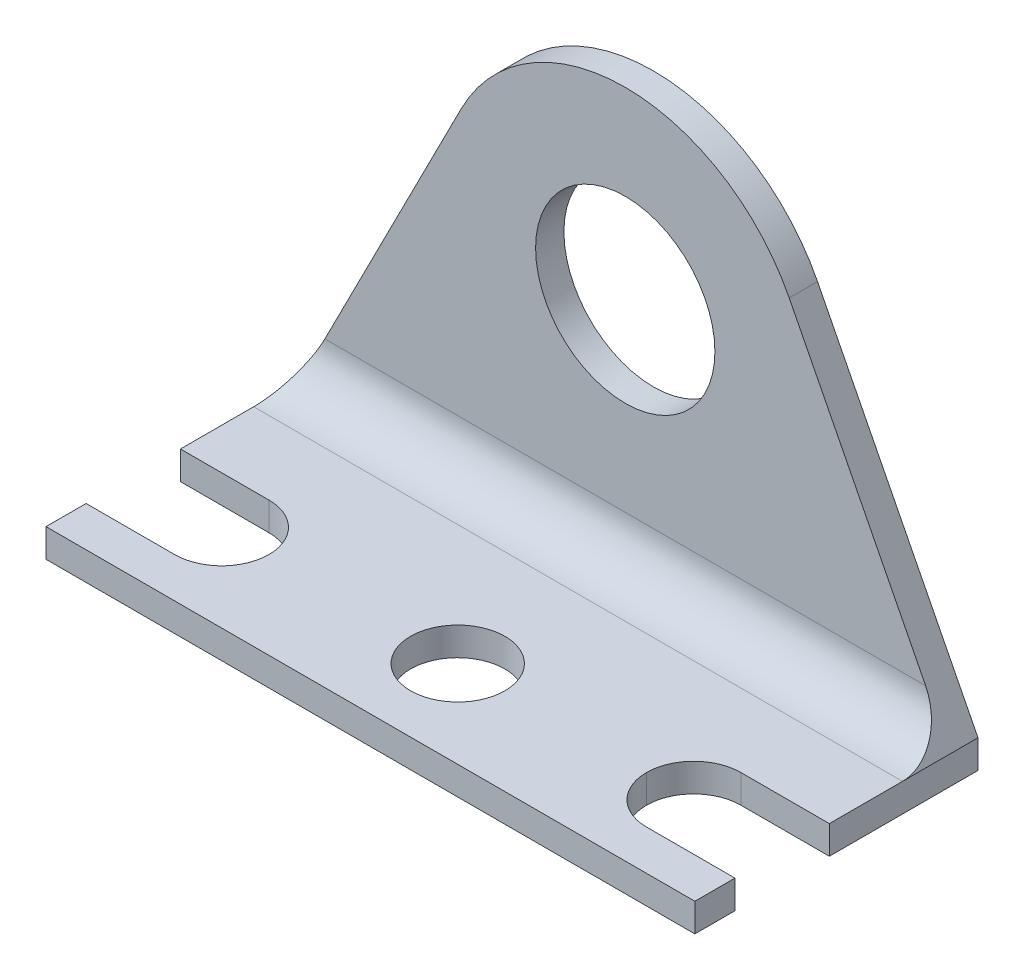
ISO-10303-21;
HEADER;
FILE_DESCRIPTION(('STEP AP214'),'2;1');
FILE_NAME('part.step','',(''),(''),'','','');
FILE_SCHEMA(('AUTOMOTIVE_DESIGN { 1 0 10303 214 1 1 1 1 }'));
ENDSEC;
DATA;
#1=APPLICATION_CONTEXT('core data for automotive mechanical design processes');
#2=APPLICATION_PROTOCOL_DEFINITION('international standard','automotive_design',2000,#1);
#3=PRODUCT_CONTEXT('',#1,'mechanical');
#4=PRODUCT('Part','Part','',(#3));
#5=PRODUCT_RELATED_PRODUCT_CATEGORY('part','',(#4));
#6=PRODUCT_DEFINITION_FORMATION('','',#4);
#7=PRODUCT_DEFINITION_CONTEXT('part definition',#1,'design');
#8=PRODUCT_DEFINITION('design','',#6,#7);
#9=PRODUCT_DEFINITION_SHAPE('','',#8);
#10=(LENGTH_UNIT() NAMED_UNIT(*) SI_UNIT(.MILLI.,.METRE.));
#11=(NAMED_UNIT(*) PLANE_ANGLE_UNIT() SI_UNIT($,.RADIAN.));
#12=(NAMED_UNIT(*) SI_UNIT($,.STERADIAN.) SOLID_ANGLE_UNIT());
#13=UNCERTAINTY_MEASURE_WITH_UNIT(LENGTH_MEASURE(1.E-05),#10,'distance_accuracy_value','');
#14=(GEOMETRIC_REPRESENTATION_CONTEXT(3) GLOBAL_UNCERTAINTY_ASSIGNED_CONTEXT((#13)) GLOBAL_UNIT_ASSIGNED_CONTEXT((#10,
#11,#12)) REPRESENTATION_CONTEXT('',''));
#15=CARTESIAN_POINT('',(0.,0.,0.));
#16=DIRECTION('',(0.,0.,1.));
#17=DIRECTION('',(1.,0.,0.));
#18=AXIS2_PLACEMENT_3D('',#15,#16,#17);
#19=CARTESIAN_POINT('',(17.4625,0.,1.524));
#20=DIRECTION('',(-1.,0.,0.));
#21=DIRECTION('',(0.,0.,1.));
#22=AXIS2_PLACEMENT_3D('',#19,#20,#21);
#23=PLANE('',#22);
#24=DIRECTION('',(0.,0.,-1.));
#25=VECTOR('',#24,1.);
#26=CARTESIAN_POINT('',(17.4625,1.524,15.24));
#27=LINE('',#26,#25);
#28=CARTESIAN_POINT('',(17.4625,1.524,8.001));
#29=VERTEX_POINT('',#28);
#30=CARTESIAN_POINT('',(17.4625,1.524,4.06400000000001));
#31=VERTEX_POINT('',#30);
#32=EDGE_CURVE('E250',#29,#31,#27,.T.);
#33=ORIENTED_EDGE('',*,*,#32,.F.);
#34=DIRECTION('',(0.,-1.,0.));
#35=VECTOR('',#34,1.);
#36=CARTESIAN_POINT('',(17.4625,0.,8.001));
#37=LINE('',#36,#35);
#38=CARTESIAN_POINT('',(17.4625,0.,8.001));
#39=VERTEX_POINT('',#38);
#40=EDGE_CURVE('E180',#29,#39,#37,.T.);
#41=ORIENTED_EDGE('',*,*,#40,.T.);
#42=DIRECTION('',(0.,0.,-1.));
#43=VECTOR('',#42,1.);
#44=CARTESIAN_POINT('',(17.4625,0.,1.524));
#45=LINE('',#44,#43);
#46=CARTESIAN_POINT('',(17.4625,0.,0.));
#47=VERTEX_POINT('',#46);
#48=EDGE_CURVE('E280',#39,#47,#45,.T.);
#49=ORIENTED_EDGE('',*,*,#48,.T.);
#50=DIRECTION('',(0.,1.,0.));
#51=VECTOR('',#50,1.);
#52=CARTESIAN_POINT('',(17.4625,0.,0.));
#53=LINE('',#52,#51);
#54=CARTESIAN_POINT('',(17.4625,1.524,0.));
#55=VERTEX_POINT('',#54);
#56=EDGE_CURVE('E259',#47,#55,#53,.T.);
#57=ORIENTED_EDGE('',*,*,#56,.T.);
#58=DIRECTION('',(0.,0.,-1.));
#59=VECTOR('',#58,1.);
#60=CARTESIAN_POINT('',(17.4625,1.524,1.524));
#61=LINE('',#60,#59);
#62=EDGE_CURVE('E51',#31,#55,#61,.T.);
#63=ORIENTED_EDGE('',*,*,#62,.F.);
#64=EDGE_LOOP('',(#33,#41,#49,#57,#63));
#65=FACE_BOUND('',#64,.T.);
#66=ADVANCED_FACE('F36',(#65),#23,.F.);
#67=CARTESIAN_POINT('',(-17.4625,0.,1.524));
#68=DIRECTION('',(1.,0.,0.));
#69=DIRECTION('',(0.,0.,-1.));
#70=AXIS2_PLACEMENT_3D('',#67,#68,#69);
#71=PLANE('',#70);
#72=DIRECTION('',(0.,-1.,0.));
#73=VECTOR('',#72,1.);
#74=CARTESIAN_POINT('',(-17.4625,57.73338257144,8.001));
#75=LINE('',#74,#73);
#76=CARTESIAN_POINT('',(-17.4625,1.524,8.001));
#77=VERTEX_POINT('',#76);
#78=CARTESIAN_POINT('',(-17.4625,0.,8.001));
#79=VERTEX_POINT('',#78);
#80=EDGE_CURVE('E220',#77,#79,#75,.T.);
#81=ORIENTED_EDGE('',*,*,#80,.F.);
#82=DIRECTION('',(0.,0.,-1.));
#83=VECTOR('',#82,1.);
#84=CARTESIAN_POINT('',(-17.4625,1.524,15.24));
#85=LINE('',#84,#83);
#86=CARTESIAN_POINT('',(-17.4625,1.524,4.06400000000001));
#87=VERTEX_POINT('',#86);
#88=EDGE_CURVE('E247',#77,#87,#85,.T.);
#89=ORIENTED_EDGE('',*,*,#88,.T.);
#90=DIRECTION('',(0.,0.,-1.));
#91=VECTOR('',#90,1.);
#92=CARTESIAN_POINT('',(-17.4625,1.524,1.524));
#93=LINE('',#92,#91);
#94=CARTESIAN_POINT('',(-17.4625,1.524,0.));
#95=VERTEX_POINT('',#94);
#96=EDGE_CURVE('E68',#87,#95,#93,.T.);
#97=ORIENTED_EDGE('',*,*,#96,.T.);
#98=DIRECTION('',(0.,-1.,0.));
#99=VECTOR('',#98,1.);
#100=CARTESIAN_POINT('',(-17.4625,0.,0.));
#101=LINE('',#100,#99);
#102=CARTESIAN_POINT('',(-17.4625,0.,0.));
#103=VERTEX_POINT('',#102);
#104=EDGE_CURVE('E268',#95,#103,#101,.T.);
#105=ORIENTED_EDGE('',*,*,#104,.T.);
#106=DIRECTION('',(0.,0.,-1.));
#107=VECTOR('',#106,1.);
#108=CARTESIAN_POINT('',(-17.4625,0.,1.524));
#109=LINE('',#108,#107);
#110=EDGE_CURVE('E284',#79,#103,#109,.T.);
#111=ORIENTED_EDGE('',*,*,#110,.F.);
#112=EDGE_LOOP('',(#81,#89,#97,#105,#111));
#113=FACE_BOUND('',#112,.T.);
#114=ADVANCED_FACE('F335',(#113),#71,.F.);
#115=DIRECTION('',(0.,-1.,0.));
#116=VECTOR('',#115,1.);
#117=CARTESIAN_POINT('',(-17.4625,57.73338257144,13.081));
#118=LINE('',#117,#116);
#119=CARTESIAN_POINT('',(-17.4625,1.524,13.081));
#120=VERTEX_POINT('',#119);
#121=CARTESIAN_POINT('',(-17.4625,0.,13.081));
#122=VERTEX_POINT('',#121);
#123=EDGE_CURVE('E208',#120,#122,#118,.T.);
#124=ORIENTED_EDGE('',*,*,#123,.T.);
#125=CARTESIAN_POINT('',(-17.4625,0.,15.24));
#126=VERTEX_POINT('',#125);
#127=EDGE_CURVE('E285',#126,#122,#109,.T.);
#128=ORIENTED_EDGE('',*,*,#127,.F.);
#129=DIRECTION('',(0.,1.,0.));
#130=VECTOR('',#129,1.);
#131=CARTESIAN_POINT('',(-17.4625,1.524,15.24));
#132=LINE('',#131,#130);
#133=CARTESIAN_POINT('',(-17.4625,1.524,15.24));
#134=VERTEX_POINT('',#133);
#135=EDGE_CURVE('E236',#126,#134,#132,.T.);
#136=ORIENTED_EDGE('',*,*,#135,.T.);
#137=EDGE_CURVE('E251',#134,#120,#85,.T.);
#138=ORIENTED_EDGE('',*,*,#137,.T.);
#139=EDGE_LOOP('',(#124,#128,#136,#138));
#140=FACE_BOUND('',#139,.T.);
#141=ADVANCED_FACE('F357',(#140),#71,.F.);
#142=CARTESIAN_POINT('',(-17.4625,0.,1.524));
#143=DIRECTION('',(0.,1.,0.));
#144=DIRECTION('',(0.,0.,1.));
#145=AXIS2_PLACEMENT_3D('',#142,#143,#144);
#146=PLANE('',#145);
#147=CARTESIAN_POINT('',(0.,0.,10.541));
#148=DIRECTION('',(0.,1.,0.));
#149=DIRECTION('',(0.,0.,1.));
#150=AXIS2_PLACEMENT_3D('',#147,#148,#149);
#151=CIRCLE('',#150,2.54);
#152=CARTESIAN_POINT('',(0.,0.,13.081));
#153=VERTEX_POINT('',#152);
#154=EDGE_CURVE('E233',#153,#153,#151,.T.);
#155=ORIENTED_EDGE('',*,*,#154,.T.);
#156=EDGE_LOOP('',(#155));
#157=FACE_BOUND('',#156,.T.);
#158=ORIENTED_EDGE('',*,*,#48,.F.);
#159=DIRECTION('',(-1.,0.,0.));
#160=VECTOR('',#159,1.);
#161=CARTESIAN_POINT('',(-17.4625,0.,8.00099999999999));
#162=LINE('',#161,#160);
#163=CARTESIAN_POINT('',(12.7,0.,8.001));
#164=VERTEX_POINT('',#163);
#165=EDGE_CURVE('E200',#39,#164,#162,.T.);
#166=ORIENTED_EDGE('',*,*,#165,.T.);
#167=CARTESIAN_POINT('',(12.7,0.,10.541));
#168=DIRECTION('',(0.,1.,0.));
#169=DIRECTION('',(0.,0.,1.));
#170=AXIS2_PLACEMENT_3D('',#167,#168,#169);
#171=CIRCLE('',#170,2.54);
#172=CARTESIAN_POINT('',(10.16,0.,10.541));
#173=VERTEX_POINT('',#172);
#174=EDGE_CURVE('E205',#164,#173,#171,.T.);
#175=ORIENTED_EDGE('',*,*,#174,.T.);
#176=CARTESIAN_POINT('',(12.7,0.,10.541));
#177=DIRECTION('',(0.,1.,0.));
#178=DIRECTION('',(0.,0.,1.));
#179=AXIS2_PLACEMENT_3D('',#176,#177,#178);
#180=CIRCLE('',#179,2.54);
#181=CARTESIAN_POINT('',(12.7,0.,13.081));
#182=VERTEX_POINT('',#181);
#183=EDGE_CURVE('E203',#173,#182,#180,.T.);
#184=ORIENTED_EDGE('',*,*,#183,.T.);
#185=DIRECTION('',(1.,0.,0.));
#186=VECTOR('',#185,1.);
#187=CARTESIAN_POINT('',(-17.4625,0.,13.081));
#188=LINE('',#187,#186);
#189=CARTESIAN_POINT('',(17.4625,0.,13.081));
#190=VERTEX_POINT('',#189);
#191=EDGE_CURVE('E184',#182,#190,#188,.T.);
#192=ORIENTED_EDGE('',*,*,#191,.T.);
#193=CARTESIAN_POINT('',(17.4625,0.,15.24));
#194=VERTEX_POINT('',#193);
#195=EDGE_CURVE('E281',#194,#190,#45,.T.);
#196=ORIENTED_EDGE('',*,*,#195,.F.);
#197=DIRECTION('',(-1.,0.,0.));
#198=VECTOR('',#197,1.);
#199=CARTESIAN_POINT('',(-17.4625,0.,15.24));
#200=LINE('',#199,#198);
#201=EDGE_CURVE('E244',#194,#126,#200,.T.);
#202=ORIENTED_EDGE('',*,*,#201,.T.);
#203=ORIENTED_EDGE('',*,*,#127,.T.);
#204=DIRECTION('',(-1.,0.,0.));
#205=VECTOR('',#204,1.);
#206=CARTESIAN_POINT('',(-17.4625,0.,13.081));
#207=LINE('',#206,#205);
#208=CARTESIAN_POINT('',(-12.7,0.,13.081));
#209=VERTEX_POINT('',#208);
#210=EDGE_CURVE('E222',#209,#122,#207,.T.);
#211=ORIENTED_EDGE('',*,*,#210,.F.);
#212=CARTESIAN_POINT('',(-12.7,0.,10.541));
#213=DIRECTION('',(0.,1.,0.));
#214=DIRECTION('',(0.,0.,1.));
#215=AXIS2_PLACEMENT_3D('',#212,#213,#214);
#216=CIRCLE('',#215,2.54);
#217=CARTESIAN_POINT('',(-10.16,0.,10.541));
#218=VERTEX_POINT('',#217);
#219=EDGE_CURVE('E224',#218,#209,#216,.F.);
#220=ORIENTED_EDGE('',*,*,#219,.F.);
#221=CARTESIAN_POINT('',(-12.7,0.,10.541));
#222=DIRECTION('',(0.,1.,0.));
#223=DIRECTION('',(0.,0.,1.));
#224=AXIS2_PLACEMENT_3D('',#221,#222,#223);
#225=CIRCLE('',#224,2.54);
#226=CARTESIAN_POINT('',(-12.7,0.,8.001));
#227=VERTEX_POINT('',#226);
#228=EDGE_CURVE('E226',#227,#218,#225,.F.);
#229=ORIENTED_EDGE('',*,*,#228,.F.);
#230=DIRECTION('',(1.,0.,0.));
#231=VECTOR('',#230,1.);
#232=CARTESIAN_POINT('',(-17.4625,0.,8.001));
#233=LINE('',#232,#231);
#234=EDGE_CURVE('E228',#79,#227,#233,.T.);
#235=ORIENTED_EDGE('',*,*,#234,.F.);
#236=ORIENTED_EDGE('',*,*,#110,.T.);
#237=DIRECTION('',(1.,0.,0.));
#238=VECTOR('',#237,1.);
#239=CARTESIAN_POINT('',(-17.4625,0.,0.));
#240=LINE('',#239,#238);
#241=EDGE_CURVE('E271',#103,#47,#240,.T.);
#242=ORIENTED_EDGE('',*,*,#241,.T.);
#243=EDGE_LOOP('',(#158,#166,#175,#184,#192,#196,#202,#203,#211,#220,#229,#235,#236,#242));
#244=FACE_BOUND('',#243,.T.);
#245=ADVANCED_FACE('F345',(#157,#244),#146,.F.);
#246=CARTESIAN_POINT('',(-17.4625,1.524,15.24));
#247=DIRECTION('',(0.,1.,0.));
#248=DIRECTION('',(0.,0.,1.));
#249=AXIS2_PLACEMENT_3D('',#246,#247,#248);
#250=PLANE('',#249);
#251=ORIENTED_EDGE('',*,*,#32,.T.);
#252=DIRECTION('',(-1.,0.,0.));
#253=VECTOR('',#252,1.);
#254=CARTESIAN_POINT('',(-17.4625,1.524,4.06400000000001));
#255=LINE('',#254,#253);
#256=EDGE_CURVE('E313',#31,#87,#255,.T.);
#257=ORIENTED_EDGE('',*,*,#256,.T.);
#258=ORIENTED_EDGE('',*,*,#88,.F.);
#259=DIRECTION('',(1.,0.,0.));
#260=VECTOR('',#259,1.);
#261=CARTESIAN_POINT('',(-17.4625,1.524,8.001));
#262=LINE('',#261,#260);
#263=CARTESIAN_POINT('',(-12.7,1.524,8.001));
#264=VERTEX_POINT('',#263);
#265=EDGE_CURVE('E305',#77,#264,#262,.T.);
#266=ORIENTED_EDGE('',*,*,#265,.T.);
#267=CARTESIAN_POINT('',(-12.7,1.524,10.541));
#268=DIRECTION('',(0.,1.,0.));
#269=DIRECTION('',(0.,0.,1.));
#270=AXIS2_PLACEMENT_3D('',#267,#268,#269);
#271=CIRCLE('',#270,2.54);
#272=CARTESIAN_POINT('',(-10.16,1.524,10.541));
#273=VERTEX_POINT('',#272);
#274=EDGE_CURVE('E302',#264,#273,#271,.F.);
#275=ORIENTED_EDGE('',*,*,#274,.T.);
#276=CARTESIAN_POINT('',(-12.7,1.524,10.541));
#277=DIRECTION('',(0.,1.,0.));
#278=DIRECTION('',(0.,0.,1.));
#279=AXIS2_PLACEMENT_3D('',#276,#277,#278);
#280=CIRCLE('',#279,2.54);
#281=CARTESIAN_POINT('',(-12.7,1.524,13.081));
#282=VERTEX_POINT('',#281);
#283=EDGE_CURVE('E299',#273,#282,#280,.F.);
#284=ORIENTED_EDGE('',*,*,#283,.T.);
#285=DIRECTION('',(-1.,0.,0.));
#286=VECTOR('',#285,1.);
#287=CARTESIAN_POINT('',(-17.4625,1.524,13.081));
#288=LINE('',#287,#286);
#289=EDGE_CURVE('E296',#282,#120,#288,.T.);
#290=ORIENTED_EDGE('',*,*,#289,.T.);
#291=ORIENTED_EDGE('',*,*,#137,.F.);
#292=DIRECTION('',(1.,0.,0.));
#293=VECTOR('',#292,1.);
#294=CARTESIAN_POINT('',(-17.4625,1.524,15.24));
#295=LINE('',#294,#293);
#296=CARTESIAN_POINT('',(17.4625,1.524,15.24));
#297=VERTEX_POINT('',#296);
#298=EDGE_CURVE('E239',#134,#297,#295,.T.);
#299=ORIENTED_EDGE('',*,*,#298,.T.);
#300=CARTESIAN_POINT('',(17.4625,1.524,13.081));
#301=VERTEX_POINT('',#300);
#302=EDGE_CURVE('E190',#297,#301,#27,.T.);
#303=ORIENTED_EDGE('',*,*,#302,.T.);
#304=DIRECTION('',(1.,0.,0.));
#305=VECTOR('',#304,1.);
#306=CARTESIAN_POINT('',(-17.4625,1.524,13.081));
#307=LINE('',#306,#305);
#308=CARTESIAN_POINT('',(12.7,1.524,13.081));
#309=VERTEX_POINT('',#308);
#310=EDGE_CURVE('E75',#309,#301,#307,.T.);
#311=ORIENTED_EDGE('',*,*,#310,.F.);
#312=CARTESIAN_POINT('',(12.7,1.524,10.541));
#313=DIRECTION('',(0.,1.,0.));
#314=DIRECTION('',(0.,0.,1.));
#315=AXIS2_PLACEMENT_3D('',#312,#313,#314);
#316=CIRCLE('',#315,2.54);
#317=CARTESIAN_POINT('',(10.16,1.524,10.541));
#318=VERTEX_POINT('',#317);
#319=EDGE_CURVE('E171',#318,#309,#316,.T.);
#320=ORIENTED_EDGE('',*,*,#319,.F.);
#321=CARTESIAN_POINT('',(12.7,1.524,10.541));
#322=DIRECTION('',(0.,1.,0.));
#323=DIRECTION('',(0.,0.,1.));
#324=AXIS2_PLACEMENT_3D('',#321,#322,#323);
#325=CIRCLE('',#324,2.54);
#326=CARTESIAN_POINT('',(12.7,1.524,8.001));
#327=VERTEX_POINT('',#326);
#328=EDGE_CURVE('E179',#327,#318,#325,.T.);
#329=ORIENTED_EDGE('',*,*,#328,.F.);
#330=DIRECTION('',(-1.,0.,0.));
#331=VECTOR('',#330,1.);
#332=CARTESIAN_POINT('',(-17.4625,1.524,8.00099999999999));
#333=LINE('',#332,#331);
#334=EDGE_CURVE('E193',#29,#327,#333,.T.);
#335=ORIENTED_EDGE('',*,*,#334,.F.);
#336=EDGE_LOOP('',(#251,#257,#258,#266,#275,#284,#290,#291,#299,#303,#311,#320,#329,#335));
#337=FACE_BOUND('',#336,.T.);
#338=CARTESIAN_POINT('',(0.,1.524,10.541));
#339=DIRECTION('',(0.,1.,0.));
#340=DIRECTION('',(0.,0.,1.));
#341=AXIS2_PLACEMENT_3D('',#338,#339,#340);
#342=CIRCLE('',#341,2.54);
#343=CARTESIAN_POINT('',(0.,1.524,13.081));
#344=VERTEX_POINT('',#343);
#345=EDGE_CURVE('E230',#344,#344,#342,.T.);
#346=ORIENTED_EDGE('',*,*,#345,.F.);
#347=EDGE_LOOP('',(#346));
#348=FACE_BOUND('',#347,.T.);
#349=ADVANCED_FACE('F187',(#337,#348),#250,.T.);
#350=CARTESIAN_POINT('',(0.,13.97,1.524));
#351=DIRECTION('',(0.,0.,1.));
#352=DIRECTION('',(1.,0.,0.));
#353=AXIS2_PLACEMENT_3D('',#350,#351,#352);
#354=PLANE('',#353);
#355=DIRECTION('',(-0.454123347646849,-0.890938822322846,0.));
#356=VECTOR('',#355,1.);
#357=CARTESIAN_POINT('',(-17.4625,1.524,1.524));
#358=LINE('',#357,#356);
#359=CARTESIAN_POINT('',(-8.82563997393013,18.4685458817897,1.524));
#360=VERTEX_POINT('',#359);
#361=CARTESIAN_POINT('',(-16.1678282738138,4.064,1.524));
#362=VERTEX_POINT('',#361);
#363=EDGE_CURVE('E278',#360,#362,#358,.T.);
#364=ORIENTED_EDGE('',*,*,#363,.T.);
#365=DIRECTION('',(-1.,0.,0.));
#366=VECTOR('',#365,1.);
#367=CARTESIAN_POINT('',(17.4625,4.064,1.524));
#368=LINE('',#367,#366);
#369=CARTESIAN_POINT('',(16.1678282738138,4.064,1.524));
#370=VERTEX_POINT('',#369);
#371=EDGE_CURVE('E316',#362,#370,#368,.F.);
#372=ORIENTED_EDGE('',*,*,#371,.T.);
#373=DIRECTION('',(-0.454123347646849,0.890938822322846,0.));
#374=VECTOR('',#373,1.);
#375=CARTESIAN_POINT('',(17.4625,1.524,1.524));
#376=LINE('',#375,#374);
#377=CARTESIAN_POINT('',(8.8256399739301,18.4685458817897,1.524));
#378=VERTEX_POINT('',#377);
#379=EDGE_CURVE('E274',#370,#378,#376,.T.);
#380=ORIENTED_EDGE('',*,*,#379,.T.);
#381=CARTESIAN_POINT('',(0.,13.97,1.524));
#382=DIRECTION('',(0.,0.,1.));
#383=DIRECTION('',(1.,0.,0.));
#384=AXIS2_PLACEMENT_3D('',#381,#382,#383);
#385=CIRCLE('',#384,9.906);
#386=EDGE_CURVE('E276',#378,#360,#385,.T.);
#387=ORIENTED_EDGE('',*,*,#386,.T.);
#388=EDGE_LOOP('',(#364,#372,#380,#387));
#389=FACE_BOUND('',#388,.T.);
#390=CARTESIAN_POINT('',(0.,13.97,1.524));
#391=DIRECTION('',(0.,0.,1.));
#392=DIRECTION('',(1.,0.,0.));
#393=AXIS2_PLACEMENT_3D('',#390,#391,#392);
#394=CIRCLE('',#393,4.826);
#395=CARTESIAN_POINT('',(-4.82600000000001,13.97,1.524));
#396=VERTEX_POINT('',#395);
#397=EDGE_CURVE('E256',#396,#396,#394,.T.);
#398=ORIENTED_EDGE('',*,*,#397,.F.);
#399=EDGE_LOOP('',(#398));
#400=FACE_BOUND('',#399,.T.);
#401=ADVANCED_FACE('F320',(#389,#400),#354,.T.);
#402=CARTESIAN_POINT('',(0.,13.97,0.));
#403=DIRECTION('',(0.,0.,1.));
#404=DIRECTION('',(1.,0.,0.));
#405=AXIS2_PLACEMENT_3D('',#402,#403,#404);
#406=PLANE('',#405);
#407=DIRECTION('',(-0.454123347646849,0.890938822322846,0.));
#408=VECTOR('',#407,1.);
#409=CARTESIAN_POINT('',(17.4625,1.524,0.));
#410=LINE('',#409,#408);
#411=CARTESIAN_POINT('',(8.82563997393011,18.4685458817897,0.));
#412=VERTEX_POINT('',#411);
#413=EDGE_CURVE('E261',#55,#412,#410,.T.);
#414=ORIENTED_EDGE('',*,*,#413,.F.);
#415=ORIENTED_EDGE('',*,*,#56,.F.);
#416=ORIENTED_EDGE('',*,*,#241,.F.);
#417=ORIENTED_EDGE('',*,*,#104,.F.);
#418=DIRECTION('',(-0.454123347646849,-0.890938822322846,0.));
#419=VECTOR('',#418,1.);
#420=CARTESIAN_POINT('',(-17.4625,1.524,0.));
#421=LINE('',#420,#419);
#422=CARTESIAN_POINT('',(-8.82563997393011,18.4685458817897,0.));
#423=VERTEX_POINT('',#422);
#424=EDGE_CURVE('E266',#423,#95,#421,.T.);
#425=ORIENTED_EDGE('',*,*,#424,.F.);
#426=CARTESIAN_POINT('',(0.,13.97,0.));
#427=DIRECTION('',(0.,0.,1.));
#428=DIRECTION('',(-1.,0.,0.));
#429=AXIS2_PLACEMENT_3D('',#426,#427,#428);
#430=CIRCLE('',#429,9.906);
#431=EDGE_CURVE('E264',#412,#423,#430,.T.);
#432=ORIENTED_EDGE('',*,*,#431,.F.);
#433=EDGE_LOOP('',(#414,#415,#416,#417,#425,#432));
#434=FACE_BOUND('',#433,.T.);
#435=CARTESIAN_POINT('',(0.,13.97,0.));
#436=DIRECTION('',(0.,0.,1.));
#437=DIRECTION('',(1.,0.,0.));
#438=AXIS2_PLACEMENT_3D('',#435,#436,#437);
#439=CIRCLE('',#438,4.826);
#440=CARTESIAN_POINT('',(-4.82600000000001,13.97,0.));
#441=VERTEX_POINT('',#440);
#442=EDGE_CURVE('E249',#441,#441,#439,.T.);
#443=ORIENTED_EDGE('',*,*,#442,.T.);
#444=EDGE_LOOP('',(#443));
#445=FACE_BOUND('',#444,.T.);
#446=ADVANCED_FACE('F365',(#434,#445),#406,.F.);
#447=ORIENTED_EDGE('',*,*,#195,.T.);
#448=DIRECTION('',(0.,1.,0.));
#449=VECTOR('',#448,1.);
#450=CARTESIAN_POINT('',(17.4625,0.,13.081));
#451=LINE('',#450,#449);
#452=EDGE_CURVE('E308',#190,#301,#451,.T.);
#453=ORIENTED_EDGE('',*,*,#452,.T.);
#454=ORIENTED_EDGE('',*,*,#302,.F.);
#455=DIRECTION('',(0.,-1.,0.));
#456=VECTOR('',#455,1.);
#457=CARTESIAN_POINT('',(17.4625,0.,15.24));
#458=LINE('',#457,#456);
#459=EDGE_CURVE('E241',#297,#194,#458,.T.);
#460=ORIENTED_EDGE('',*,*,#459,.T.);
#461=EDGE_LOOP('',(#447,#453,#454,#460));
#462=FACE_BOUND('',#461,.T.);
#463=ADVANCED_FACE('F38',(#462),#23,.F.);
#464=CARTESIAN_POINT('',(17.4625,1.524,1.524));
#465=DIRECTION('',(-0.890938822322845,-0.454123347646849,0.));
#466=DIRECTION('',(0.454123347646849,-0.890938822322846,0.));
#467=AXIS2_PLACEMENT_3D('',#464,#465,#466);
#468=PLANE('',#467);
#469=ORIENTED_EDGE('',*,*,#413,.T.);
#470=DIRECTION('',(0.,0.,-1.));
#471=VECTOR('',#470,1.);
#472=CARTESIAN_POINT('',(8.8256399739301,18.4685458817897,1.524));
#473=LINE('',#472,#471);
#474=EDGE_CURVE('E292',#378,#412,#473,.T.);
#475=ORIENTED_EDGE('',*,*,#474,.F.);
#476=ORIENTED_EDGE('',*,*,#379,.F.);
#477=CARTESIAN_POINT('',(16.1678282738138,4.064,4.064));
#478=DIRECTION('',(-0.890938822322845,-0.454123347646849,0.));
#479=DIRECTION('',(0.454123347646849,-0.890938822322846,0.));
#480=AXIS2_PLACEMENT_3D('',#477,#478,#479);
#481=ELLIPSE('',#480,2.85092526709942,2.54);
#482=EDGE_CURVE('E11',#370,#31,#481,.T.);
#483=ORIENTED_EDGE('',*,*,#482,.T.);
#484=ORIENTED_EDGE('',*,*,#62,.T.);
#485=EDGE_LOOP('',(#469,#475,#476,#483,#484));
#486=FACE_BOUND('',#485,.T.);
#487=ADVANCED_FACE('F326',(#486),#468,.F.);
#488=CARTESIAN_POINT('',(0.,13.97,1.524));
#489=DIRECTION('',(0.,0.,-1.));
#490=DIRECTION('',(-1.,0.,0.));
#491=AXIS2_PLACEMENT_3D('',#488,#489,#490);
#492=CYLINDRICAL_SURFACE('',#491,9.906);
#493=ORIENTED_EDGE('',*,*,#431,.T.);
#494=DIRECTION('',(0.,0.,-1.));
#495=VECTOR('',#494,1.);
#496=CARTESIAN_POINT('',(-8.82563997393013,18.4685458817897,1.524));
#497=LINE('',#496,#495);
#498=EDGE_CURVE('E289',#360,#423,#497,.T.);
#499=ORIENTED_EDGE('',*,*,#498,.F.);
#500=ORIENTED_EDGE('',*,*,#386,.F.);
#501=ORIENTED_EDGE('',*,*,#474,.T.);
#502=EDGE_LOOP('',(#493,#499,#500,#501));
#503=FACE_BOUND('',#502,.T.);
#504=ADVANCED_FACE('F370',(#503),#492,.T.);
#505=CARTESIAN_POINT('',(-17.4625,1.524,1.524));
#506=DIRECTION('',(0.890938822322845,-0.454123347646849,0.));
#507=DIRECTION('',(0.454123347646849,0.890938822322846,0.));
#508=AXIS2_PLACEMENT_3D('',#505,#506,#507);
#509=PLANE('',#508);
#510=ORIENTED_EDGE('',*,*,#424,.T.);
#511=ORIENTED_EDGE('',*,*,#96,.F.);
#512=CARTESIAN_POINT('',(-16.1678282738138,4.064,4.064));
#513=DIRECTION('',(0.890938822322845,-0.454123347646849,0.));
#514=DIRECTION('',(0.454123347646849,0.890938822322846,0.));
#515=AXIS2_PLACEMENT_3D('',#512,#513,#514);
#516=ELLIPSE('',#515,2.85092526709942,2.54);
#517=EDGE_CURVE('E44',#87,#362,#516,.T.);
#518=ORIENTED_EDGE('',*,*,#517,.T.);
#519=ORIENTED_EDGE('',*,*,#363,.F.);
#520=ORIENTED_EDGE('',*,*,#498,.T.);
#521=EDGE_LOOP('',(#510,#511,#518,#519,#520));
#522=FACE_BOUND('',#521,.T.);
#523=ADVANCED_FACE('F385',(#522),#509,.F.);
#524=CARTESIAN_POINT('',(0.,13.97,1.524));
#525=DIRECTION('',(0.,0.,-1.));
#526=DIRECTION('',(-1.,0.,0.));
#527=AXIS2_PLACEMENT_3D('',#524,#525,#526);
#528=CYLINDRICAL_SURFACE('',#527,4.826);
#529=CARTESIAN_POINT('',(-4.82600000000001,13.97,1.524));
#530=CARTESIAN_POINT('',(-4.82600000000001,13.97,1.508125));
#531=CARTESIAN_POINT('',(-4.82600000000001,13.97,1.49225));
#532=CARTESIAN_POINT('',(-4.82600000000001,13.97,1.4605));
#533=CARTESIAN_POINT('',(-4.82600000000001,13.97,1.444625));
#534=CARTESIAN_POINT('',(-4.82600000000001,13.97,1.412875));
#535=CARTESIAN_POINT('',(-4.82600000000001,13.97,1.397));
#536=CARTESIAN_POINT('',(-4.82600000000001,13.97,1.36525));
#537=CARTESIAN_POINT('',(-4.82600000000001,13.97,1.349375));
#538=CARTESIAN_POINT('',(-4.82600000000001,13.97,1.317625));
#539=CARTESIAN_POINT('',(-4.82600000000001,13.97,1.30175));
#540=CARTESIAN_POINT('',(-4.82600000000001,13.97,1.27));
#541=CARTESIAN_POINT('',(-4.82600000000001,13.97,1.254125));
#542=CARTESIAN_POINT('',(-4.82600000000001,13.97,1.222375));
#543=CARTESIAN_POINT('',(-4.82600000000001,13.97,1.2065));
#544=CARTESIAN_POINT('',(-4.82600000000001,13.97,1.17475));
#545=CARTESIAN_POINT('',(-4.82600000000001,13.97,1.158875));
#546=CARTESIAN_POINT('',(-4.82600000000001,13.97,1.127125));
#547=CARTESIAN_POINT('',(-4.82600000000001,13.97,1.11125));
#548=CARTESIAN_POINT('',(-4.82600000000001,13.97,1.0795));
#549=CARTESIAN_POINT('',(-4.82600000000001,13.97,1.063625));
#550=CARTESIAN_POINT('',(-4.82600000000001,13.97,1.031875));
#551=CARTESIAN_POINT('',(-4.82600000000001,13.97,1.016));
#552=CARTESIAN_POINT('',(-4.82600000000001,13.97,0.984249999999998));
#553=CARTESIAN_POINT('',(-4.82600000000001,13.97,0.968374999999998));
#554=CARTESIAN_POINT('',(-4.82600000000001,13.97,0.936624999999998));
#555=CARTESIAN_POINT('',(-4.82600000000001,13.97,0.920749999999998));
#556=CARTESIAN_POINT('',(-4.82600000000001,13.97,0.888999999999999));
#557=CARTESIAN_POINT('',(-4.82600000000001,13.97,0.873124999999998));
#558=CARTESIAN_POINT('',(-4.82600000000001,13.97,0.841374999999999));
#559=CARTESIAN_POINT('',(-4.82600000000001,13.97,0.825499999999999));
#560=CARTESIAN_POINT('',(-4.82600000000001,13.97,0.793749999999999));
#561=CARTESIAN_POINT('',(-4.82600000000001,13.97,0.777874999999999));
#562=CARTESIAN_POINT('',(-4.82600000000001,13.97,0.746124999999999));
#563=CARTESIAN_POINT('',(-4.82600000000001,13.97,0.730249999999999));
#564=CARTESIAN_POINT('',(-4.82600000000001,13.97,0.698499999999999));
#565=CARTESIAN_POINT('',(-4.82600000000001,13.97,0.682624999999999));
#566=CARTESIAN_POINT('',(-4.82600000000001,13.97,0.650874999999999));
#567=CARTESIAN_POINT('',(-4.82600000000001,13.97,0.634999999999999));
#568=CARTESIAN_POINT('',(-4.82600000000001,13.97,0.603249999999999));
#569=CARTESIAN_POINT('',(-4.82600000000001,13.97,0.587374999999999));
#570=CARTESIAN_POINT('',(-4.82600000000001,13.97,0.555624999999999));
#571=CARTESIAN_POINT('',(-4.82600000000001,13.97,0.539749999999999));
#572=CARTESIAN_POINT('',(-4.82600000000001,13.97,0.507999999999999));
#573=CARTESIAN_POINT('',(-4.82600000000001,13.97,0.492124999999999));
#574=CARTESIAN_POINT('',(-4.82600000000001,13.97,0.460374999999999));
#575=CARTESIAN_POINT('',(-4.82600000000001,13.97,0.444499999999999));
#576=CARTESIAN_POINT('',(-4.82600000000001,13.97,0.412749999999999));
#577=CARTESIAN_POINT('',(-4.82600000000001,13.97,0.396874999999999));
#578=CARTESIAN_POINT('',(-4.82600000000001,13.97,0.365124999999999));
#579=CARTESIAN_POINT('',(-4.82600000000001,13.97,0.349249999999999));
#580=CARTESIAN_POINT('',(-4.82600000000001,13.97,0.317499999999999));
#581=CARTESIAN_POINT('',(-4.82600000000001,13.97,0.301624999999999));
#582=CARTESIAN_POINT('',(-4.82600000000001,13.97,0.269874999999999));
#583=CARTESIAN_POINT('',(-4.82600000000001,13.97,0.253999999999999));
#584=CARTESIAN_POINT('',(-4.82600000000001,13.97,0.222249999999999));
#585=CARTESIAN_POINT('',(-4.82600000000001,13.97,0.206374999999999));
#586=CARTESIAN_POINT('',(-4.82600000000001,13.97,0.174625));
#587=CARTESIAN_POINT('',(-4.82600000000001,13.97,0.15875));
#588=CARTESIAN_POINT('',(-4.82600000000001,13.97,0.127));
#589=CARTESIAN_POINT('',(-4.82600000000001,13.97,0.111125));
#590=CARTESIAN_POINT('',(-4.82600000000001,13.97,0.0793749999999997));
#591=CARTESIAN_POINT('',(-4.82600000000001,13.97,0.0634999999999997));
#592=CARTESIAN_POINT('',(-4.82600000000001,13.97,0.0317499999999997));
#593=CARTESIAN_POINT('',(-4.82600000000001,13.97,0.0158749999999998));
#594=CARTESIAN_POINT('',(-4.82600000000001,13.97,0.));
#595=B_SPLINE_CURVE_WITH_KNOTS('',3,(#529,#530,#531,#532,#533,#534,#535,#536,#537,#538,#539,
#540,#541,#542,#543,#544,#545,#546,#547,#548,#549,#550,#551,#552,#553,#554,#555,#556,#557,#558,
#559,#560,#561,#562,#563,#564,#565,#566,#567,#568,#569,#570,#571,#572,#573,#574,#575,#576,#577,
#578,#579,#580,#581,#582,#583,#584,#585,#586,#587,#588,#589,#590,#591,#592,#593,#594),
.UNSPECIFIED.,.F.,.F.,(4,2,2,2,2,2,2,2,2,2,2,2,2,2,2,2,2,2,2,2,2,2,2,2,2,2,2,2,2,2,2,2,4),(0.,
0.0476249999999997,0.0952499999999996,0.142875,0.190499999999999,0.238124999999999,
0.285749999999999,0.333374999999999,0.380999999999999,0.428624999999999,0.476249999999999,
0.523874999999999,0.571499999999999,0.619124999999999,0.666749999999999,0.714374999999999,
0.761999999999999,0.809624999999999,0.857249999999999,0.904874999999998,0.952499999999998,
1.000125,1.04775,1.095375,1.143,1.190625,1.23825,1.285875,1.3335,1.381125,1.42875,1.476375,
1.524),.UNSPECIFIED.);
#596=EDGE_CURVE('BSEAM387',#396,#441,#595,.T.);
#597=ORIENTED_EDGE('',*,*,#397,.T.);
#598=ORIENTED_EDGE('',*,*,#442,.F.);
#599=ORIENTED_EDGE('',*,*,#596,.T.);
#600=ORIENTED_EDGE('',*,*,#596,.F.);
#601=EDGE_LOOP('',(#597,#599,#598,#600));
#602=FACE_BOUND('',#601,.T.);
#603=ADVANCED_FACE('F387',(#602),#528,.F.);
#604=CARTESIAN_POINT('',(-17.4625,0.,15.24));
#605=DIRECTION('',(0.,0.,1.));
#606=DIRECTION('',(1.,0.,0.));
#607=AXIS2_PLACEMENT_3D('',#604,#605,#606);
#608=PLANE('',#607);
#609=ORIENTED_EDGE('',*,*,#135,.F.);
#610=ORIENTED_EDGE('',*,*,#201,.F.);
#611=ORIENTED_EDGE('',*,*,#459,.F.);
#612=ORIENTED_EDGE('',*,*,#298,.F.);
#613=EDGE_LOOP('',(#609,#610,#611,#612));
#614=FACE_BOUND('',#613,.T.);
#615=ADVANCED_FACE('F361',(#614),#608,.T.);
#616=CARTESIAN_POINT('',(0.,0.,10.541));
#617=DIRECTION('',(0.,1.,0.));
#618=DIRECTION('',(0.,0.,1.));
#619=AXIS2_PLACEMENT_3D('',#616,#617,#618);
#620=CYLINDRICAL_SURFACE('',#619,2.54);
#621=CARTESIAN_POINT('',(0.,0.,13.081));
#622=CARTESIAN_POINT('',(0.,0.015875,13.081));
#623=CARTESIAN_POINT('',(0.,0.03175,13.081));
#624=CARTESIAN_POINT('',(0.,0.0635,13.081));
#625=CARTESIAN_POINT('',(0.,0.079375,13.081));
#626=CARTESIAN_POINT('',(0.,0.111125,13.081));
#627=CARTESIAN_POINT('',(0.,0.127,13.081));
#628=CARTESIAN_POINT('',(0.,0.15875,13.081));
#629=CARTESIAN_POINT('',(0.,0.174625,13.081));
#630=CARTESIAN_POINT('',(0.,0.206375,13.081));
#631=CARTESIAN_POINT('',(0.,0.22225,13.081));
#632=CARTESIAN_POINT('',(0.,0.254,13.081));
#633=CARTESIAN_POINT('',(0.,0.269875,13.081));
#634=CARTESIAN_POINT('',(0.,0.301625,13.081));
#635=CARTESIAN_POINT('',(0.,0.3175,13.081));
#636=CARTESIAN_POINT('',(0.,0.34925,13.081));
#637=CARTESIAN_POINT('',(0.,0.365125,13.081));
#638=CARTESIAN_POINT('',(0.,0.396875,13.081));
#639=CARTESIAN_POINT('',(0.,0.41275,13.081));
#640=CARTESIAN_POINT('',(0.,0.4445,13.081));
#641=CARTESIAN_POINT('',(0.,0.460375,13.081));
#642=CARTESIAN_POINT('',(0.,0.492125,13.081));
#643=CARTESIAN_POINT('',(0.,0.508,13.081));
#644=CARTESIAN_POINT('',(0.,0.53975,13.081));
#645=CARTESIAN_POINT('',(0.,0.555625,13.081));
#646=CARTESIAN_POINT('',(0.,0.587375,13.081));
#647=CARTESIAN_POINT('',(0.,0.60325,13.081));
#648=CARTESIAN_POINT('',(0.,0.635,13.081));
#649=CARTESIAN_POINT('',(0.,0.650875,13.081));
#650=CARTESIAN_POINT('',(0.,0.682625,13.081));
#651=CARTESIAN_POINT('',(0.,0.6985,13.081));
#652=CARTESIAN_POINT('',(0.,0.73025,13.081));
#653=CARTESIAN_POINT('',(0.,0.746125,13.081));
#654=CARTESIAN_POINT('',(0.,0.777875,13.081));
#655=CARTESIAN_POINT('',(0.,0.79375,13.081));
#656=CARTESIAN_POINT('',(0.,0.8255,13.081));
#657=CARTESIAN_POINT('',(0.,0.841375,13.081));
#658=CARTESIAN_POINT('',(0.,0.873125,13.081));
#659=CARTESIAN_POINT('',(0.,0.889,13.081));
#660=CARTESIAN_POINT('',(0.,0.920750000000001,13.081));
#661=CARTESIAN_POINT('',(0.,0.936625,13.081));
#662=CARTESIAN_POINT('',(0.,0.968375,13.081));
#663=CARTESIAN_POINT('',(0.,0.98425,13.081));
#664=CARTESIAN_POINT('',(0.,1.016,13.081));
#665=CARTESIAN_POINT('',(0.,1.031875,13.081));
#666=CARTESIAN_POINT('',(0.,1.063625,13.081));
#667=CARTESIAN_POINT('',(0.,1.0795,13.081));
#668=CARTESIAN_POINT('',(0.,1.11125,13.081));
#669=CARTESIAN_POINT('',(0.,1.127125,13.081));
#670=CARTESIAN_POINT('',(0.,1.158875,13.081));
#671=CARTESIAN_POINT('',(0.,1.17475,13.081));
#672=CARTESIAN_POINT('',(0.,1.2065,13.081));
#673=CARTESIAN_POINT('',(0.,1.222375,13.081));
#674=CARTESIAN_POINT('',(0.,1.254125,13.081));
#675=CARTESIAN_POINT('',(0.,1.27,13.081));
#676=CARTESIAN_POINT('',(0.,1.30175,13.081));
#677=CARTESIAN_POINT('',(0.,1.317625,13.081));
#678=CARTESIAN_POINT('',(0.,1.349375,13.081));
#679=CARTESIAN_POINT('',(0.,1.36525,13.081));
#680=CARTESIAN_POINT('',(0.,1.397,13.081));
#681=CARTESIAN_POINT('',(0.,1.412875,13.081));
#682=CARTESIAN_POINT('',(0.,1.444625,13.081));
#683=CARTESIAN_POINT('',(0.,1.4605,13.081));
#684=CARTESIAN_POINT('',(0.,1.49225,13.081));
#685=CARTESIAN_POINT('',(0.,1.508125,13.081));
#686=CARTESIAN_POINT('',(0.,1.524,13.081));
#687=B_SPLINE_CURVE_WITH_KNOTS('',3,(#621,#622,#623,#624,#625,#626,#627,#628,#629,#630,#631,
#632,#633,#634,#635,#636,#637,#638,#639,#640,#641,#642,#643,#644,#645,#646,#647,#648,#649,#650,
#651,#652,#653,#654,#655,#656,#657,#658,#659,#660,#661,#662,#663,#664,#665,#666,#667,#668,#669,
#670,#671,#672,#673,#674,#675,#676,#677,#678,#679,#680,#681,#682,#683,#684,#685,#686),
.UNSPECIFIED.,.F.,.F.,(4,2,2,2,2,2,2,2,2,2,2,2,2,2,2,2,2,2,2,2,2,2,2,2,2,2,2,2,2,2,2,2,4),(0.,
0.047625,0.0952500000000001,0.142875,0.1905,0.238125,0.28575,0.333375,0.381,0.428625,0.47625,
0.523875,0.5715,0.619125,0.66675,0.714375,0.762,0.809625,0.857250000000001,0.904875000000001,
0.952500000000001,1.000125,1.04775,1.095375,1.143,1.190625,1.23825,1.285875,1.3335,1.381125,
1.42875,1.476375,1.524),.UNSPECIFIED.);
#688=EDGE_CURVE('BSEAM406',#153,#344,#687,.T.);
#689=ORIENTED_EDGE('',*,*,#154,.F.);
#690=ORIENTED_EDGE('',*,*,#345,.T.);
#691=ORIENTED_EDGE('',*,*,#688,.T.);
#692=ORIENTED_EDGE('',*,*,#688,.F.);
#693=EDGE_LOOP('',(#689,#691,#690,#692));
#694=FACE_BOUND('',#693,.T.);
#695=ADVANCED_FACE('F406',(#694),#620,.F.);
#696=CARTESIAN_POINT('',(-17.4625,57.73338257144,8.001));
#697=DIRECTION('',(0.,0.,1.));
#698=DIRECTION('',(1.,0.,0.));
#699=AXIS2_PLACEMENT_3D('',#696,#697,#698);
#700=PLANE('',#699);
#701=ORIENTED_EDGE('',*,*,#80,.T.);
#702=ORIENTED_EDGE('',*,*,#234,.T.);
#703=DIRECTION('',(0.,-1.,0.));
#704=VECTOR('',#703,1.);
#705=CARTESIAN_POINT('',(-12.7,57.73338257144,8.001));
#706=LINE('',#705,#704);
#707=EDGE_CURVE('E217',#264,#227,#706,.T.);
#708=ORIENTED_EDGE('',*,*,#707,.F.);
#709=ORIENTED_EDGE('',*,*,#265,.F.);
#710=EDGE_LOOP('',(#701,#702,#708,#709));
#711=FACE_BOUND('',#710,.T.);
#712=ADVANCED_FACE('F340',(#711),#700,.T.);
#713=CARTESIAN_POINT('',(-12.7,57.73338257144,10.541));
#714=DIRECTION('',(0.,-1.,0.));
#715=DIRECTION('',(0.,0.,-1.));
#716=AXIS2_PLACEMENT_3D('',#713,#714,#715);
#717=CYLINDRICAL_SURFACE('',#716,2.54);
#718=ORIENTED_EDGE('',*,*,#707,.T.);
#719=ORIENTED_EDGE('',*,*,#228,.T.);
#720=DIRECTION('',(0.,-1.,0.));
#721=VECTOR('',#720,1.);
#722=CARTESIAN_POINT('',(-10.16,57.73338257144,10.541));
#723=LINE('',#722,#721);
#724=EDGE_CURVE('E214',#273,#218,#723,.T.);
#725=ORIENTED_EDGE('',*,*,#724,.F.);
#726=ORIENTED_EDGE('',*,*,#274,.F.);
#727=EDGE_LOOP('',(#718,#719,#725,#726));
#728=FACE_BOUND('',#727,.T.);
#729=ADVANCED_FACE('F350',(#728),#717,.F.);
#730=CARTESIAN_POINT('',(-12.7,57.73338257144,10.541));
#731=DIRECTION('',(0.,-1.,0.));
#732=DIRECTION('',(0.,0.,-1.));
#733=AXIS2_PLACEMENT_3D('',#730,#731,#732);
#734=CYLINDRICAL_SURFACE('',#733,2.54);
#735=ORIENTED_EDGE('',*,*,#724,.T.);
#736=ORIENTED_EDGE('',*,*,#219,.T.);
#737=DIRECTION('',(0.,-1.,0.));
#738=VECTOR('',#737,1.);
#739=CARTESIAN_POINT('',(-12.7,57.73338257144,13.081));
#740=LINE('',#739,#738);
#741=EDGE_CURVE('E211',#282,#209,#740,.T.);
#742=ORIENTED_EDGE('',*,*,#741,.F.);
#743=ORIENTED_EDGE('',*,*,#283,.F.);
#744=EDGE_LOOP('',(#735,#736,#742,#743));
#745=FACE_BOUND('',#744,.T.);
#746=ADVANCED_FACE('F352',(#745),#734,.F.);
#747=CARTESIAN_POINT('',(-17.4625,57.73338257144,13.081));
#748=DIRECTION('',(0.,0.,-1.));
#749=DIRECTION('',(-1.,0.,0.));
#750=AXIS2_PLACEMENT_3D('',#747,#748,#749);
#751=PLANE('',#750);
#752=ORIENTED_EDGE('',*,*,#741,.T.);
#753=ORIENTED_EDGE('',*,*,#210,.T.);
#754=ORIENTED_EDGE('',*,*,#123,.F.);
#755=ORIENTED_EDGE('',*,*,#289,.F.);
#756=EDGE_LOOP('',(#752,#753,#754,#755));
#757=FACE_BOUND('',#756,.T.);
#758=ADVANCED_FACE('F416',(#757),#751,.T.);
#759=CARTESIAN_POINT('',(12.7,57.73338257144,10.541));
#760=DIRECTION('',(0.,-1.,0.));
#761=DIRECTION('',(0.,0.,-1.));
#762=AXIS2_PLACEMENT_3D('',#759,#760,#761);
#763=CYLINDRICAL_SURFACE('',#762,2.54);
#764=ORIENTED_EDGE('',*,*,#174,.F.);
#765=DIRECTION('',(0.,-1.,0.));
#766=VECTOR('',#765,1.);
#767=CARTESIAN_POINT('',(12.7,57.73338257144,8.001));
#768=LINE('',#767,#766);
#769=EDGE_CURVE('E191',#327,#164,#768,.T.);
#770=ORIENTED_EDGE('',*,*,#769,.F.);
#771=ORIENTED_EDGE('',*,*,#328,.T.);
#772=DIRECTION('',(0.,-1.,0.));
#773=VECTOR('',#772,1.);
#774=CARTESIAN_POINT('',(10.16,57.73338257144,10.541));
#775=LINE('',#774,#773);
#776=EDGE_CURVE('E176',#318,#173,#775,.T.);
#777=ORIENTED_EDGE('',*,*,#776,.T.);
#778=EDGE_LOOP('',(#764,#770,#771,#777));
#779=FACE_BOUND('',#778,.T.);
#780=ADVANCED_FACE('F419',(#779),#763,.F.);
#781=CARTESIAN_POINT('',(12.7,57.73338257144,10.541));
#782=DIRECTION('',(0.,-1.,0.));
#783=DIRECTION('',(0.,0.,-1.));
#784=AXIS2_PLACEMENT_3D('',#781,#782,#783);
#785=CYLINDRICAL_SURFACE('',#784,2.54);
#786=ORIENTED_EDGE('',*,*,#183,.F.);
#787=ORIENTED_EDGE('',*,*,#776,.F.);
#788=ORIENTED_EDGE('',*,*,#319,.T.);
#789=DIRECTION('',(0.,-1.,0.));
#790=VECTOR('',#789,1.);
#791=CARTESIAN_POINT('',(12.7,57.73338257144,13.081));
#792=LINE('',#791,#790);
#793=EDGE_CURVE('E173',#309,#182,#792,.T.);
#794=ORIENTED_EDGE('',*,*,#793,.T.);
#795=EDGE_LOOP('',(#786,#787,#788,#794));
#796=FACE_BOUND('',#795,.T.);
#797=ADVANCED_FACE('F172',(#796),#785,.F.);
#798=CARTESIAN_POINT('',(17.4625,57.73338257144,8.001));
#799=DIRECTION('',(0.,0.,-1.));
#800=DIRECTION('',(-1.,0.,0.));
#801=AXIS2_PLACEMENT_3D('',#798,#799,#800);
#802=PLANE('',#801);
#803=ORIENTED_EDGE('',*,*,#165,.F.);
#804=ORIENTED_EDGE('',*,*,#40,.F.);
#805=ORIENTED_EDGE('',*,*,#334,.T.);
#806=ORIENTED_EDGE('',*,*,#769,.T.);
#807=EDGE_LOOP('',(#803,#804,#805,#806));
#808=FACE_BOUND('',#807,.T.);
#809=ADVANCED_FACE('F420',(#808),#802,.F.);
#810=CARTESIAN_POINT('',(17.4625,57.73338257144,13.081));
#811=DIRECTION('',(0.,0.,1.));
#812=DIRECTION('',(1.,0.,0.));
#813=AXIS2_PLACEMENT_3D('',#810,#811,#812);
#814=PLANE('',#813);
#815=ORIENTED_EDGE('',*,*,#191,.F.);
#816=ORIENTED_EDGE('',*,*,#793,.F.);
#817=ORIENTED_EDGE('',*,*,#310,.T.);
#818=ORIENTED_EDGE('',*,*,#452,.F.);
#819=EDGE_LOOP('',(#815,#816,#817,#818));
#820=FACE_BOUND('',#819,.T.);
#821=ADVANCED_FACE('F182',(#820),#814,.F.);
#822=CARTESIAN_POINT('',(-17.4625,4.064,4.06400000000001));
#823=DIRECTION('',(1.,0.,0.));
#824=DIRECTION('',(0.,0.,-1.));
#825=AXIS2_PLACEMENT_3D('',#822,#823,#824);
#826=CYLINDRICAL_SURFACE('',#825,2.54);
#827=ORIENTED_EDGE('',*,*,#482,.F.);
#828=ORIENTED_EDGE('',*,*,#371,.F.);
#829=ORIENTED_EDGE('',*,*,#517,.F.);
#830=ORIENTED_EDGE('',*,*,#256,.F.);
#831=EDGE_LOOP('',(#827,#828,#829,#830));
#832=FACE_BOUND('',#831,.T.);
#833=ADVANCED_FACE('F329',(#832),#826,.F.);
#834=CLOSED_SHELL('',(#66,#114,#141,#245,#349,#401,#446,#463,#487,#504,#523,#603,#615,#695,#712,
#729,#746,#758,#780,#797,#809,#821,#833));
#835=MANIFOLD_SOLID_BREP('B2',#834);
#836=ADVANCED_BREP_SHAPE_REPRESENTATION('',(#18,#835),#14);
#837=SHAPE_DEFINITION_REPRESENTATION(#9,#836);
ENDSEC;
END-ISO-10303-21;
